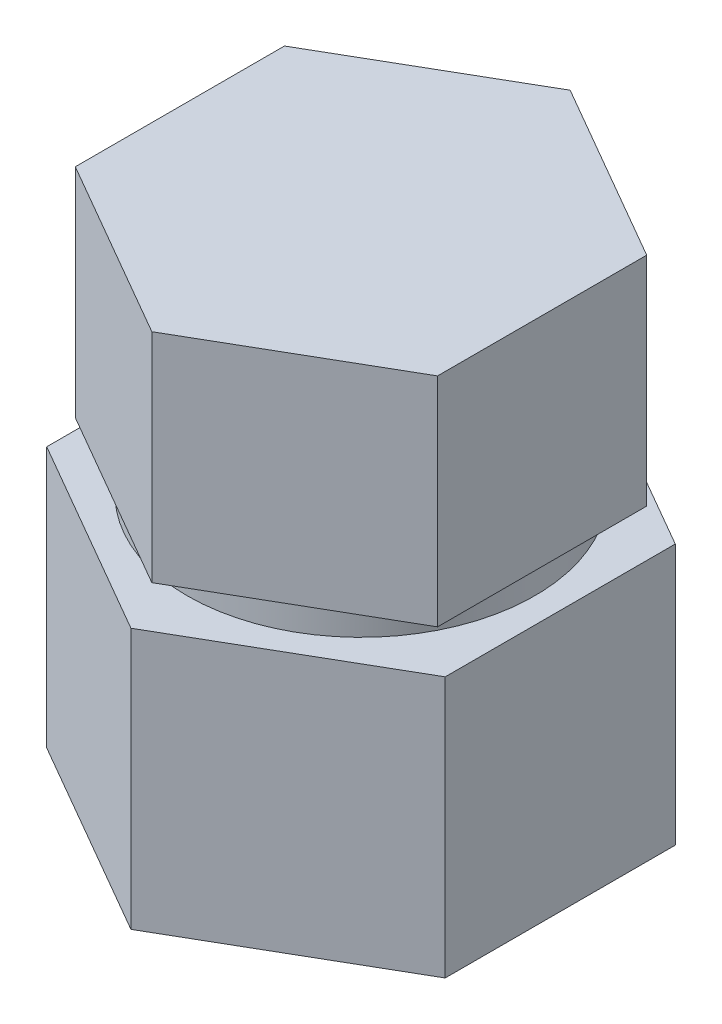
ISO-10303-21;
HEADER;
FILE_DESCRIPTION(('STEP AP214'),'2;1');
FILE_NAME('part.step','',(''),(''),'','','');
FILE_SCHEMA(('AUTOMOTIVE_DESIGN { 1 0 10303 214 1 1 1 1 }'));
ENDSEC;
DATA;
#1=APPLICATION_CONTEXT('core data for automotive mechanical design processes');
#2=APPLICATION_PROTOCOL_DEFINITION('international standard','automotive_design',2000,#1);
#3=PRODUCT_CONTEXT('',#1,'mechanical');
#4=PRODUCT('Part','Part','',(#3));
#5=PRODUCT_RELATED_PRODUCT_CATEGORY('part','',(#4));
#6=PRODUCT_DEFINITION_FORMATION('','',#4);
#7=PRODUCT_DEFINITION_CONTEXT('part definition',#1,'design');
#8=PRODUCT_DEFINITION('design','',#6,#7);
#9=PRODUCT_DEFINITION_SHAPE('','',#8);
#10=(LENGTH_UNIT() NAMED_UNIT(*) SI_UNIT(.MILLI.,.METRE.));
#11=(NAMED_UNIT(*) PLANE_ANGLE_UNIT() SI_UNIT($,.RADIAN.));
#12=(NAMED_UNIT(*) SI_UNIT($,.STERADIAN.) SOLID_ANGLE_UNIT());
#13=UNCERTAINTY_MEASURE_WITH_UNIT(LENGTH_MEASURE(1.E-05),#10,'distance_accuracy_value','');
#14=(GEOMETRIC_REPRESENTATION_CONTEXT(3) GLOBAL_UNCERTAINTY_ASSIGNED_CONTEXT((#13)) GLOBAL_UNIT_ASSIGNED_CONTEXT((#10,
#11,#12)) REPRESENTATION_CONTEXT('',''));
#15=CARTESIAN_POINT('',(0.,0.,0.));
#16=DIRECTION('',(0.,0.,1.));
#17=DIRECTION('',(1.,0.,0.));
#18=AXIS2_PLACEMENT_3D('',#15,#16,#17);
#19=CARTESIAN_POINT('',(-2.49999999999997,-3.,1.44337567297409));
#20=DIRECTION('',(-0.499999999999995,0.,0.866025403784441));
#21=DIRECTION('',(0.866025403784441,0.,0.499999999999995));
#22=AXIS2_PLACEMENT_3D('',#19,#20,#21);
#23=PLANE('',#22);
#24=DIRECTION('',(0.866025403784441,0.,0.499999999999995));
#25=VECTOR('',#24,1.);
#26=CARTESIAN_POINT('',(-2.49999999999997,0.,1.44337567297409));
#27=LINE('',#26,#25);
#28=CARTESIAN_POINT('',(-2.49999999999997,0.,1.44337567297409));
#29=VERTEX_POINT('',#28);
#30=CARTESIAN_POINT('',(0.,0.,2.88675134594812));
#31=VERTEX_POINT('',#30);
#32=EDGE_CURVE('E126',#29,#31,#27,.T.);
#33=ORIENTED_EDGE('',*,*,#32,.F.);
#34=DIRECTION('',(0.,1.,0.));
#35=VECTOR('',#34,1.);
#36=CARTESIAN_POINT('',(-2.49999999999997,-3.,1.44337567297409));
#37=LINE('',#36,#35);
#38=CARTESIAN_POINT('',(-2.49999999999997,-3.,1.44337567297409));
#39=VERTEX_POINT('',#38);
#40=EDGE_CURVE('E44',#39,#29,#37,.T.);
#41=ORIENTED_EDGE('',*,*,#40,.F.);
#42=DIRECTION('',(0.866025403784441,0.,0.499999999999995));
#43=VECTOR('',#42,1.);
#44=CARTESIAN_POINT('',(-2.49999999999997,-3.,1.44337567297409));
#45=LINE('',#44,#43);
#46=CARTESIAN_POINT('',(0.,-3.,2.88675134594812));
#47=VERTEX_POINT('',#46);
#48=EDGE_CURVE('E142',#39,#47,#45,.T.);
#49=ORIENTED_EDGE('',*,*,#48,.T.);
#50=DIRECTION('',(0.,1.,0.));
#51=VECTOR('',#50,1.);
#52=CARTESIAN_POINT('',(0.,-3.,2.88675134594812));
#53=LINE('',#52,#51);
#54=EDGE_CURVE('E38',#47,#31,#53,.T.);
#55=ORIENTED_EDGE('',*,*,#54,.T.);
#56=EDGE_LOOP('',(#33,#41,#49,#55));
#57=FACE_BOUND('',#56,.T.);
#58=ADVANCED_FACE('F35',(#57),#23,.T.);
#59=CARTESIAN_POINT('',(-2.5,-3.,-1.44337567297403));
#60=DIRECTION('',(-1.,0.,0.));
#61=DIRECTION('',(0.,0.,1.));
#62=AXIS2_PLACEMENT_3D('',#59,#60,#61);
#63=PLANE('',#62);
#64=DIRECTION('',(0.,0.,1.));
#65=VECTOR('',#64,1.);
#66=CARTESIAN_POINT('',(-2.5,0.,-1.44337567297403));
#67=LINE('',#66,#65);
#68=CARTESIAN_POINT('',(-2.5,0.,-1.44337567297403));
#69=VERTEX_POINT('',#68);
#70=EDGE_CURVE('E139',#69,#29,#67,.T.);
#71=ORIENTED_EDGE('',*,*,#70,.F.);
#72=DIRECTION('',(0.,1.,0.));
#73=VECTOR('',#72,1.);
#74=CARTESIAN_POINT('',(-2.5,-3.,-1.44337567297403));
#75=LINE('',#74,#73);
#76=CARTESIAN_POINT('',(-2.5,-3.,-1.44337567297403));
#77=VERTEX_POINT('',#76);
#78=EDGE_CURVE('E76',#77,#69,#75,.T.);
#79=ORIENTED_EDGE('',*,*,#78,.F.);
#80=DIRECTION('',(0.,0.,1.));
#81=VECTOR('',#80,1.);
#82=CARTESIAN_POINT('',(-2.5,-3.,-1.44337567297403));
#83=LINE('',#82,#81);
#84=EDGE_CURVE('E116',#77,#39,#83,.T.);
#85=ORIENTED_EDGE('',*,*,#84,.T.);
#86=ORIENTED_EDGE('',*,*,#40,.T.);
#87=EDGE_LOOP('',(#71,#79,#85,#86));
#88=FACE_BOUND('',#87,.T.);
#89=ADVANCED_FACE('F150',(#88),#63,.T.);
#90=CARTESIAN_POINT('',(0.,-3.,-2.88675134594811));
#91=DIRECTION('',(-0.500000000000007,0.,-0.866025403784435));
#92=DIRECTION('',(-0.866025403784434,0.,0.500000000000007));
#93=AXIS2_PLACEMENT_3D('',#90,#91,#92);
#94=PLANE('',#93);
#95=DIRECTION('',(-0.866025403784434,0.,0.500000000000007));
#96=VECTOR('',#95,1.);
#97=CARTESIAN_POINT('',(0.,0.,-2.88675134594811));
#98=LINE('',#97,#96);
#99=CARTESIAN_POINT('',(0.,0.,-2.88675134594811));
#100=VERTEX_POINT('',#99);
#101=EDGE_CURVE('E103',#100,#69,#98,.T.);
#102=ORIENTED_EDGE('',*,*,#101,.F.);
#103=DIRECTION('',(0.,1.,0.));
#104=VECTOR('',#103,1.);
#105=CARTESIAN_POINT('',(0.,-3.,-2.88675134594811));
#106=LINE('',#105,#104);
#107=CARTESIAN_POINT('',(0.,-3.,-2.88675134594811));
#108=VERTEX_POINT('',#107);
#109=EDGE_CURVE('E98',#108,#100,#106,.T.);
#110=ORIENTED_EDGE('',*,*,#109,.F.);
#111=DIRECTION('',(-0.866025403784434,0.,0.500000000000007));
#112=VECTOR('',#111,1.);
#113=CARTESIAN_POINT('',(0.,-3.,-2.88675134594811));
#114=LINE('',#113,#112);
#115=EDGE_CURVE('E101',#108,#77,#114,.T.);
#116=ORIENTED_EDGE('',*,*,#115,.T.);
#117=ORIENTED_EDGE('',*,*,#78,.T.);
#118=EDGE_LOOP('',(#102,#110,#116,#117));
#119=FACE_BOUND('',#118,.T.);
#120=ADVANCED_FACE('F100',(#119),#94,.T.);
#121=CARTESIAN_POINT('',(2.49999999999998,-3.,-1.44337567297407));
#122=DIRECTION('',(0.499999999999995,0.,-0.866025403784442));
#123=DIRECTION('',(-0.866025403784442,0.,-0.499999999999995));
#124=AXIS2_PLACEMENT_3D('',#121,#122,#123);
#125=PLANE('',#124);
#126=DIRECTION('',(-0.866025403784441,0.,-0.499999999999995));
#127=VECTOR('',#126,1.);
#128=CARTESIAN_POINT('',(2.49999999999998,0.,-1.44337567297407));
#129=LINE('',#128,#127);
#130=CARTESIAN_POINT('',(2.49999999999998,0.,-1.44337567297407));
#131=VERTEX_POINT('',#130);
#132=EDGE_CURVE('E136',#131,#100,#129,.T.);
#133=ORIENTED_EDGE('',*,*,#132,.F.);
#134=DIRECTION('',(0.,1.,0.));
#135=VECTOR('',#134,1.);
#136=CARTESIAN_POINT('',(2.49999999999998,-3.,-1.44337567297407));
#137=LINE('',#136,#135);
#138=CARTESIAN_POINT('',(2.49999999999998,-3.,-1.44337567297407));
#139=VERTEX_POINT('',#138);
#140=EDGE_CURVE('E108',#139,#131,#137,.T.);
#141=ORIENTED_EDGE('',*,*,#140,.F.);
#142=DIRECTION('',(-0.866025403784441,0.,-0.499999999999995));
#143=VECTOR('',#142,1.);
#144=CARTESIAN_POINT('',(2.49999999999998,-3.,-1.44337567297407));
#145=LINE('',#144,#143);
#146=EDGE_CURVE('E114',#139,#108,#145,.T.);
#147=ORIENTED_EDGE('',*,*,#146,.T.);
#148=ORIENTED_EDGE('',*,*,#109,.T.);
#149=EDGE_LOOP('',(#133,#141,#147,#148));
#150=FACE_BOUND('',#149,.T.);
#151=ADVANCED_FACE('F118',(#150),#125,.T.);
#152=CARTESIAN_POINT('',(2.49999999999999,-3.,1.44337567297405));
#153=DIRECTION('',(1.,0.,0.));
#154=DIRECTION('',(0.,0.,-1.));
#155=AXIS2_PLACEMENT_3D('',#152,#153,#154);
#156=PLANE('',#155);
#157=DIRECTION('',(0.,0.,-1.));
#158=VECTOR('',#157,1.);
#159=CARTESIAN_POINT('',(2.49999999999999,0.,1.44337567297405));
#160=LINE('',#159,#158);
#161=CARTESIAN_POINT('',(2.49999999999999,0.,1.44337567297405));
#162=VERTEX_POINT('',#161);
#163=EDGE_CURVE('E133',#162,#131,#160,.T.);
#164=ORIENTED_EDGE('',*,*,#163,.F.);
#165=DIRECTION('',(0.,1.,0.));
#166=VECTOR('',#165,1.);
#167=CARTESIAN_POINT('',(2.49999999999999,-3.,1.44337567297405));
#168=LINE('',#167,#166);
#169=CARTESIAN_POINT('',(2.49999999999999,-3.,1.44337567297405));
#170=VERTEX_POINT('',#169);
#171=EDGE_CURVE('E145',#170,#162,#168,.T.);
#172=ORIENTED_EDGE('',*,*,#171,.F.);
#173=DIRECTION('',(0.,0.,-1.));
#174=VECTOR('',#173,1.);
#175=CARTESIAN_POINT('',(2.49999999999999,-3.,1.44337567297405));
#176=LINE('',#175,#174);
#177=EDGE_CURVE('E119',#170,#139,#176,.T.);
#178=ORIENTED_EDGE('',*,*,#177,.T.);
#179=ORIENTED_EDGE('',*,*,#140,.T.);
#180=EDGE_LOOP('',(#164,#172,#178,#179));
#181=FACE_BOUND('',#180,.T.);
#182=ADVANCED_FACE('F163',(#181),#156,.T.);
#183=CARTESIAN_POINT('',(0.,-3.,2.88675134594812));
#184=DIRECTION('',(0.500000000000001,0.,0.866025403784438));
#185=DIRECTION('',(0.866025403784438,0.,-0.500000000000001));
#186=AXIS2_PLACEMENT_3D('',#183,#184,#185);
#187=PLANE('',#186);
#188=DIRECTION('',(0.866025403784438,0.,-0.500000000000001));
#189=VECTOR('',#188,1.);
#190=CARTESIAN_POINT('',(0.,0.,2.88675134594812));
#191=LINE('',#190,#189);
#192=EDGE_CURVE('E129',#31,#162,#191,.T.);
#193=ORIENTED_EDGE('',*,*,#192,.F.);
#194=ORIENTED_EDGE('',*,*,#54,.F.);
#195=DIRECTION('',(0.866025403784438,0.,-0.500000000000001));
#196=VECTOR('',#195,1.);
#197=CARTESIAN_POINT('',(0.,-3.,2.88675134594812));
#198=LINE('',#197,#196);
#199=EDGE_CURVE('E121',#47,#170,#198,.T.);
#200=ORIENTED_EDGE('',*,*,#199,.T.);
#201=ORIENTED_EDGE('',*,*,#171,.T.);
#202=EDGE_LOOP('',(#193,#194,#200,#201));
#203=FACE_BOUND('',#202,.T.);
#204=ADVANCED_FACE('F147',(#203),#187,.T.);
#205=CARTESIAN_POINT('',(0.,-3.,0.));
#206=DIRECTION('',(0.,1.,0.));
#207=DIRECTION('',(0.,0.,1.));
#208=AXIS2_PLACEMENT_3D('',#205,#206,#207);
#209=PLANE('',#208);
#210=CARTESIAN_POINT('',(0.,-3.,0.));
#211=DIRECTION('',(0.,-1.,0.));
#212=DIRECTION('',(0.,0.,-1.));
#213=AXIS2_PLACEMENT_3D('',#210,#211,#212);
#214=CIRCLE('',#213,2.4);
#215=CARTESIAN_POINT('',(0.,-3.,-2.4));
#216=VERTEX_POINT('',#215);
#217=EDGE_CURVE('E11',#216,#216,#214,.T.);
#218=ORIENTED_EDGE('',*,*,#217,.F.);
#219=EDGE_LOOP('',(#218));
#220=FACE_BOUND('',#219,.T.);
#221=ORIENTED_EDGE('',*,*,#48,.F.);
#222=ORIENTED_EDGE('',*,*,#84,.F.);
#223=ORIENTED_EDGE('',*,*,#115,.F.);
#224=ORIENTED_EDGE('',*,*,#146,.F.);
#225=ORIENTED_EDGE('',*,*,#177,.F.);
#226=ORIENTED_EDGE('',*,*,#199,.F.);
#227=EDGE_LOOP('',(#221,#222,#223,#224,#225,#226));
#228=FACE_BOUND('',#227,.T.);
#229=ADVANCED_FACE('F112',(#220,#228),#209,.F.);
#230=CARTESIAN_POINT('',(0.,0.,0.));
#231=DIRECTION('',(0.,1.,0.));
#232=DIRECTION('',(0.,0.,1.));
#233=AXIS2_PLACEMENT_3D('',#230,#231,#232);
#234=PLANE('',#233);
#235=ORIENTED_EDGE('',*,*,#32,.T.);
#236=ORIENTED_EDGE('',*,*,#192,.T.);
#237=ORIENTED_EDGE('',*,*,#163,.T.);
#238=ORIENTED_EDGE('',*,*,#132,.T.);
#239=ORIENTED_EDGE('',*,*,#101,.T.);
#240=ORIENTED_EDGE('',*,*,#70,.T.);
#241=EDGE_LOOP('',(#235,#236,#237,#238,#239,#240));
#242=FACE_BOUND('',#241,.T.);
#243=ADVANCED_FACE('F149',(#242),#234,.T.);
#244=CARTESIAN_POINT('',(0.,-3.4,0.));
#245=DIRECTION('',(0.,1.,0.));
#246=DIRECTION('',(0.,0.,1.));
#247=AXIS2_PLACEMENT_3D('',#244,#245,#246);
#248=CYLINDRICAL_SURFACE('',#247,2.4);
#249=CARTESIAN_POINT('',(0.,-3.4,0.));
#250=DIRECTION('',(0.,-1.,0.));
#251=DIRECTION('',(0.,0.,-1.));
#252=AXIS2_PLACEMENT_3D('',#249,#250,#251);
#253=CIRCLE('',#252,2.4);
#254=CARTESIAN_POINT('',(0.,-3.4,-2.4));
#255=VERTEX_POINT('',#254);
#256=EDGE_CURVE('E130',#255,#255,#253,.T.);
#257=ORIENTED_EDGE('',*,*,#256,.F.);
#258=EDGE_LOOP('',(#257));
#259=FACE_BOUND('',#258,.T.);
#260=ORIENTED_EDGE('',*,*,#217,.T.);
#261=EDGE_LOOP('',(#260));
#262=FACE_BOUND('',#261,.T.);
#263=ADVANCED_FACE('F174',(#259,#262),#248,.T.);
#264=CARTESIAN_POINT('',(-2.75,-7.,-1.58771324027147));
#265=DIRECTION('',(0.5,0.,0.866025403784438));
#266=DIRECTION('',(0.866025403784439,0.,-0.5));
#267=AXIS2_PLACEMENT_3D('',#264,#265,#266);
#268=PLANE('',#267);
#269=DIRECTION('',(0.866025403784439,0.,-0.5));
#270=VECTOR('',#269,1.);
#271=CARTESIAN_POINT('',(-2.75,-3.4,-1.58771324027147));
#272=LINE('',#271,#270);
#273=CARTESIAN_POINT('',(-2.75,-3.4,-1.58771324027147));
#274=VERTEX_POINT('',#273);
#275=CARTESIAN_POINT('',(0.,-3.4,-3.17542648054294));
#276=VERTEX_POINT('',#275);
#277=EDGE_CURVE('E238',#274,#276,#272,.T.);
#278=ORIENTED_EDGE('',*,*,#277,.T.);
#279=DIRECTION('',(0.,1.,0.));
#280=VECTOR('',#279,1.);
#281=CARTESIAN_POINT('',(0.,-7.,-3.17542648054294));
#282=LINE('',#281,#280);
#283=CARTESIAN_POINT('',(0.,-7.,-3.17542648054294));
#284=VERTEX_POINT('',#283);
#285=EDGE_CURVE('E235',#284,#276,#282,.T.);
#286=ORIENTED_EDGE('',*,*,#285,.F.);
#287=DIRECTION('',(0.866025403784439,0.,-0.5));
#288=VECTOR('',#287,1.);
#289=CARTESIAN_POINT('',(-2.75,-7.,-1.58771324027147));
#290=LINE('',#289,#288);
#291=CARTESIAN_POINT('',(-2.75,-7.,-1.58771324027147));
#292=VERTEX_POINT('',#291);
#293=EDGE_CURVE('E218',#292,#284,#290,.T.);
#294=ORIENTED_EDGE('',*,*,#293,.F.);
#295=DIRECTION('',(0.,1.,0.));
#296=VECTOR('',#295,1.);
#297=CARTESIAN_POINT('',(-2.75,-7.,-1.58771324027147));
#298=LINE('',#297,#296);
#299=EDGE_CURVE('E257',#292,#274,#298,.T.);
#300=ORIENTED_EDGE('',*,*,#299,.T.);
#301=EDGE_LOOP('',(#278,#286,#294,#300));
#302=FACE_BOUND('',#301,.T.);
#303=ADVANCED_FACE('F179',(#302),#268,.F.);
#304=CARTESIAN_POINT('',(0.,-7.,-3.17542648054294));
#305=DIRECTION('',(-0.5,0.,0.866025403784438));
#306=DIRECTION('',(0.866025403784439,0.,0.5));
#307=AXIS2_PLACEMENT_3D('',#304,#305,#306);
#308=PLANE('',#307);
#309=DIRECTION('',(0.866025403784439,0.,0.5));
#310=VECTOR('',#309,1.);
#311=CARTESIAN_POINT('',(0.,-3.4,-3.17542648054294));
#312=LINE('',#311,#310);
#313=CARTESIAN_POINT('',(2.75,-3.4,-1.58771324027147));
#314=VERTEX_POINT('',#313);
#315=EDGE_CURVE('E270',#276,#314,#312,.T.);
#316=ORIENTED_EDGE('',*,*,#315,.T.);
#317=DIRECTION('',(0.,1.,0.));
#318=VECTOR('',#317,1.);
#319=CARTESIAN_POINT('',(2.75,-7.,-1.58771324027147));
#320=LINE('',#319,#318);
#321=CARTESIAN_POINT('',(2.75,-7.,-1.58771324027147));
#322=VERTEX_POINT('',#321);
#323=EDGE_CURVE('E240',#322,#314,#320,.T.);
#324=ORIENTED_EDGE('',*,*,#323,.F.);
#325=DIRECTION('',(0.866025403784439,0.,0.5));
#326=VECTOR('',#325,1.);
#327=CARTESIAN_POINT('',(0.,-7.,-3.17542648054294));
#328=LINE('',#327,#326);
#329=EDGE_CURVE('E223',#284,#322,#328,.T.);
#330=ORIENTED_EDGE('',*,*,#329,.F.);
#331=ORIENTED_EDGE('',*,*,#285,.T.);
#332=EDGE_LOOP('',(#316,#324,#330,#331));
#333=FACE_BOUND('',#332,.T.);
#334=ADVANCED_FACE('F183',(#333),#308,.F.);
#335=CARTESIAN_POINT('',(2.75,-7.,-1.58771324027147));
#336=DIRECTION('',(-1.,0.,0.));
#337=DIRECTION('',(0.,0.,1.));
#338=AXIS2_PLACEMENT_3D('',#335,#336,#337);
#339=PLANE('',#338);
#340=DIRECTION('',(0.,0.,1.));
#341=VECTOR('',#340,1.);
#342=CARTESIAN_POINT('',(2.75,-3.4,-1.58771324027147));
#343=LINE('',#342,#341);
#344=CARTESIAN_POINT('',(2.75,-3.4,1.58771324027147));
#345=VERTEX_POINT('',#344);
#346=EDGE_CURVE('E267',#314,#345,#343,.T.);
#347=ORIENTED_EDGE('',*,*,#346,.T.);
#348=DIRECTION('',(0.,1.,0.));
#349=VECTOR('',#348,1.);
#350=CARTESIAN_POINT('',(2.75,-7.,1.58771324027147));
#351=LINE('',#350,#349);
#352=CARTESIAN_POINT('',(2.75,-7.,1.58771324027147));
#353=VERTEX_POINT('',#352);
#354=EDGE_CURVE('E245',#353,#345,#351,.T.);
#355=ORIENTED_EDGE('',*,*,#354,.F.);
#356=DIRECTION('',(0.,0.,1.));
#357=VECTOR('',#356,1.);
#358=CARTESIAN_POINT('',(2.75,-7.,-1.58771324027147));
#359=LINE('',#358,#357);
#360=EDGE_CURVE('E279',#322,#353,#359,.T.);
#361=ORIENTED_EDGE('',*,*,#360,.F.);
#362=ORIENTED_EDGE('',*,*,#323,.T.);
#363=EDGE_LOOP('',(#347,#355,#361,#362));
#364=FACE_BOUND('',#363,.T.);
#365=ADVANCED_FACE('F187',(#364),#339,.F.);
#366=CARTESIAN_POINT('',(2.75,-7.,1.58771324027147));
#367=DIRECTION('',(-0.5,0.,-0.866025403784439));
#368=DIRECTION('',(-0.866025403784439,0.,0.5));
#369=AXIS2_PLACEMENT_3D('',#366,#367,#368);
#370=PLANE('',#369);
#371=DIRECTION('',(-0.866025403784439,0.,0.5));
#372=VECTOR('',#371,1.);
#373=CARTESIAN_POINT('',(2.75,-3.4,1.58771324027147));
#374=LINE('',#373,#372);
#375=CARTESIAN_POINT('',(0.,-3.4,3.17542648054294));
#376=VERTEX_POINT('',#375);
#377=EDGE_CURVE('E264',#345,#376,#374,.T.);
#378=ORIENTED_EDGE('',*,*,#377,.T.);
#379=DIRECTION('',(0.,1.,0.));
#380=VECTOR('',#379,1.);
#381=CARTESIAN_POINT('',(0.,-7.,3.17542648054294));
#382=LINE('',#381,#380);
#383=CARTESIAN_POINT('',(0.,-7.,3.17542648054294));
#384=VERTEX_POINT('',#383);
#385=EDGE_CURVE('E251',#384,#376,#382,.T.);
#386=ORIENTED_EDGE('',*,*,#385,.F.);
#387=DIRECTION('',(-0.866025403784439,0.,0.5));
#388=VECTOR('',#387,1.);
#389=CARTESIAN_POINT('',(2.75,-7.,1.58771324027147));
#390=LINE('',#389,#388);
#391=EDGE_CURVE('E276',#353,#384,#390,.T.);
#392=ORIENTED_EDGE('',*,*,#391,.F.);
#393=ORIENTED_EDGE('',*,*,#354,.T.);
#394=EDGE_LOOP('',(#378,#386,#392,#393));
#395=FACE_BOUND('',#394,.T.);
#396=ADVANCED_FACE('F191',(#395),#370,.F.);
#397=CARTESIAN_POINT('',(0.,-7.,3.17542648054294));
#398=DIRECTION('',(0.5,0.,-0.866025403784438));
#399=DIRECTION('',(-0.866025403784439,0.,-0.5));
#400=AXIS2_PLACEMENT_3D('',#397,#398,#399);
#401=PLANE('',#400);
#402=DIRECTION('',(-0.866025403784439,0.,-0.5));
#403=VECTOR('',#402,1.);
#404=CARTESIAN_POINT('',(0.,-3.4,3.17542648054294));
#405=LINE('',#404,#403);
#406=CARTESIAN_POINT('',(-2.75,-3.4,1.58771324027147));
#407=VERTEX_POINT('',#406);
#408=EDGE_CURVE('E261',#376,#407,#405,.T.);
#409=ORIENTED_EDGE('',*,*,#408,.T.);
#410=DIRECTION('',(0.,1.,0.));
#411=VECTOR('',#410,1.);
#412=CARTESIAN_POINT('',(-2.75,-7.,1.58771324027147));
#413=LINE('',#412,#411);
#414=CARTESIAN_POINT('',(-2.75,-7.,1.58771324027147));
#415=VERTEX_POINT('',#414);
#416=EDGE_CURVE('E254',#415,#407,#413,.T.);
#417=ORIENTED_EDGE('',*,*,#416,.F.);
#418=DIRECTION('',(-0.866025403784439,0.,-0.5));
#419=VECTOR('',#418,1.);
#420=CARTESIAN_POINT('',(0.,-7.,3.17542648054294));
#421=LINE('',#420,#419);
#422=EDGE_CURVE('E274',#384,#415,#421,.T.);
#423=ORIENTED_EDGE('',*,*,#422,.F.);
#424=ORIENTED_EDGE('',*,*,#385,.T.);
#425=EDGE_LOOP('',(#409,#417,#423,#424));
#426=FACE_BOUND('',#425,.T.);
#427=ADVANCED_FACE('F195',(#426),#401,.F.);
#428=CARTESIAN_POINT('',(-2.75,-7.,1.58771324027147));
#429=DIRECTION('',(1.,0.,0.));
#430=DIRECTION('',(0.,0.,-1.));
#431=AXIS2_PLACEMENT_3D('',#428,#429,#430);
#432=PLANE('',#431);
#433=DIRECTION('',(0.,0.,-1.));
#434=VECTOR('',#433,1.);
#435=CARTESIAN_POINT('',(-2.75,-3.4,1.58771324027147));
#436=LINE('',#435,#434);
#437=EDGE_CURVE('E231',#407,#274,#436,.T.);
#438=ORIENTED_EDGE('',*,*,#437,.T.);
#439=ORIENTED_EDGE('',*,*,#299,.F.);
#440=DIRECTION('',(0.,0.,-1.));
#441=VECTOR('',#440,1.);
#442=CARTESIAN_POINT('',(-2.75,-7.,1.58771324027147));
#443=LINE('',#442,#441);
#444=EDGE_CURVE('E227',#415,#292,#443,.T.);
#445=ORIENTED_EDGE('',*,*,#444,.F.);
#446=ORIENTED_EDGE('',*,*,#416,.T.);
#447=EDGE_LOOP('',(#438,#439,#445,#446));
#448=FACE_BOUND('',#447,.T.);
#449=ADVANCED_FACE('F199',(#448),#432,.F.);
#450=CARTESIAN_POINT('',(0.,-7.,0.));
#451=DIRECTION('',(0.,-1.,0.));
#452=DIRECTION('',(0.,0.,-1.));
#453=AXIS2_PLACEMENT_3D('',#450,#451,#452);
#454=PLANE('',#453);
#455=ORIENTED_EDGE('',*,*,#293,.T.);
#456=ORIENTED_EDGE('',*,*,#329,.T.);
#457=ORIENTED_EDGE('',*,*,#360,.T.);
#458=ORIENTED_EDGE('',*,*,#391,.T.);
#459=ORIENTED_EDGE('',*,*,#422,.T.);
#460=ORIENTED_EDGE('',*,*,#444,.T.);
#461=EDGE_LOOP('',(#455,#456,#457,#458,#459,#460));
#462=FACE_BOUND('',#461,.T.);
#463=ADVANCED_FACE('F203',(#462),#454,.T.);
#464=CARTESIAN_POINT('',(0.,-3.4,0.));
#465=DIRECTION('',(0.,-1.,0.));
#466=DIRECTION('',(0.,0.,-1.));
#467=AXIS2_PLACEMENT_3D('',#464,#465,#466);
#468=PLANE('',#467);
#469=ORIENTED_EDGE('',*,*,#256,.T.);
#470=EDGE_LOOP('',(#469));
#471=FACE_BOUND('',#470,.T.);
#472=ORIENTED_EDGE('',*,*,#277,.F.);
#473=ORIENTED_EDGE('',*,*,#437,.F.);
#474=ORIENTED_EDGE('',*,*,#408,.F.);
#475=ORIENTED_EDGE('',*,*,#377,.F.);
#476=ORIENTED_EDGE('',*,*,#346,.F.);
#477=ORIENTED_EDGE('',*,*,#315,.F.);
#478=EDGE_LOOP('',(#472,#473,#474,#475,#476,#477));
#479=FACE_BOUND('',#478,.T.);
#480=ADVANCED_FACE('F205',(#471,#479),#468,.F.);
#481=CLOSED_SHELL('',(#58,#89,#120,#151,#182,#204,#229,#243,#263,#303,#334,#365,#396,#427,#449,
#463,#480));
#482=MANIFOLD_SOLID_BREP('B2',#481);
#483=ADVANCED_BREP_SHAPE_REPRESENTATION('',(#18,#482),#14);
#484=SHAPE_DEFINITION_REPRESENTATION(#9,#483);
ENDSEC;
END-ISO-10303-21;
